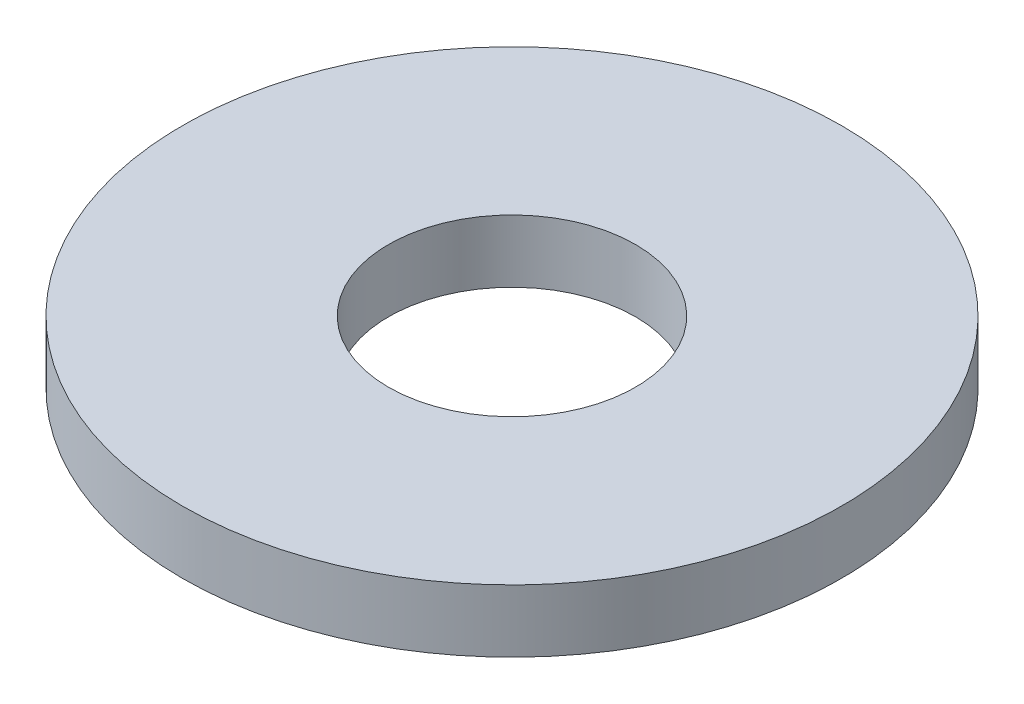
ISO-10303-21;
HEADER;
FILE_DESCRIPTION(('STEP AP214'),'2;1');
FILE_NAME('part.step','',(''),(''),'','','');
FILE_SCHEMA(('AUTOMOTIVE_DESIGN { 1 0 10303 214 1 1 1 1 }'));
ENDSEC;
DATA;
#1=APPLICATION_CONTEXT('core data for automotive mechanical design processes');
#2=APPLICATION_PROTOCOL_DEFINITION('international standard','automotive_design',2000,#1);
#3=PRODUCT_CONTEXT('',#1,'mechanical');
#4=PRODUCT('Part','Part','',(#3));
#5=PRODUCT_RELATED_PRODUCT_CATEGORY('part','',(#4));
#6=PRODUCT_DEFINITION_FORMATION('','',#4);
#7=PRODUCT_DEFINITION_CONTEXT('part definition',#1,'design');
#8=PRODUCT_DEFINITION('design','',#6,#7);
#9=PRODUCT_DEFINITION_SHAPE('','',#8);
#10=(LENGTH_UNIT() NAMED_UNIT(*) SI_UNIT(.MILLI.,.METRE.));
#11=(NAMED_UNIT(*) PLANE_ANGLE_UNIT() SI_UNIT($,.RADIAN.));
#12=(NAMED_UNIT(*) SI_UNIT($,.STERADIAN.) SOLID_ANGLE_UNIT());
#13=UNCERTAINTY_MEASURE_WITH_UNIT(LENGTH_MEASURE(1.E-05),#10,'distance_accuracy_value','');
#14=(GEOMETRIC_REPRESENTATION_CONTEXT(3) GLOBAL_UNCERTAINTY_ASSIGNED_CONTEXT((#13)) GLOBAL_UNIT_ASSIGNED_CONTEXT((#10,
#11,#12)) REPRESENTATION_CONTEXT('',''));
#15=CARTESIAN_POINT('',(0.,0.,0.));
#16=DIRECTION('',(0.,0.,1.));
#17=DIRECTION('',(1.,0.,0.));
#18=AXIS2_PLACEMENT_3D('',#15,#16,#17);
#19=CARTESIAN_POINT('',(0.,19.,0.));
#20=DIRECTION('',(0.,-1.,0.));
#21=DIRECTION('',(0.,0.,-1.));
#22=AXIS2_PLACEMENT_3D('',#19,#20,#21);
#23=CYLINDRICAL_SURFACE('',#22,100.);
#24=CARTESIAN_POINT('',(0.,19.,0.));
#25=DIRECTION('',(0.,1.,0.));
#26=DIRECTION('',(0.,0.,1.));
#27=AXIS2_PLACEMENT_3D('',#24,#25,#26);
#28=CIRCLE('',#27,100.);
#29=CARTESIAN_POINT('',(0.,19.,100.));
#30=VERTEX_POINT('',#29);
#31=EDGE_CURVE('E10',#30,#30,#28,.T.);
#32=ORIENTED_EDGE('',*,*,#31,.F.);
#33=EDGE_LOOP('',(#32));
#34=FACE_BOUND('',#33,.T.);
#35=CARTESIAN_POINT('',(0.,0.,0.));
#36=DIRECTION('',(0.,1.,0.));
#37=DIRECTION('',(0.,0.,1.));
#38=AXIS2_PLACEMENT_3D('',#35,#36,#37);
#39=CIRCLE('',#38,100.);
#40=CARTESIAN_POINT('',(0.,0.,100.));
#41=VERTEX_POINT('',#40);
#42=EDGE_CURVE('E37',#41,#41,#39,.T.);
#43=ORIENTED_EDGE('',*,*,#42,.T.);
#44=EDGE_LOOP('',(#43));
#45=FACE_BOUND('',#44,.T.);
#46=ADVANCED_FACE('F40',(#34,#45),#23,.T.);
#47=CARTESIAN_POINT('',(0.,19.,0.));
#48=DIRECTION('',(0.,1.,0.));
#49=DIRECTION('',(0.,0.,1.));
#50=AXIS2_PLACEMENT_3D('',#47,#48,#49);
#51=PLANE('',#50);
#52=CARTESIAN_POINT('',(0.,19.,0.));
#53=DIRECTION('',(0.,1.,0.));
#54=DIRECTION('',(0.,0.,1.));
#55=AXIS2_PLACEMENT_3D('',#52,#53,#54);
#56=CIRCLE('',#55,37.5);
#57=CARTESIAN_POINT('',(0.,19.,37.5));
#58=VERTEX_POINT('',#57);
#59=EDGE_CURVE('E50',#58,#58,#56,.T.);
#60=ORIENTED_EDGE('',*,*,#59,.F.);
#61=EDGE_LOOP('',(#60));
#62=FACE_BOUND('',#61,.T.);
#63=ORIENTED_EDGE('',*,*,#31,.T.);
#64=EDGE_LOOP('',(#63));
#65=FACE_BOUND('',#64,.T.);
#66=ADVANCED_FACE('F59',(#62,#65),#51,.T.);
#67=CARTESIAN_POINT('',(0.,0.,0.));
#68=DIRECTION('',(0.,1.,0.));
#69=DIRECTION('',(0.,0.,1.));
#70=AXIS2_PLACEMENT_3D('',#67,#68,#69);
#71=PLANE('',#70);
#72=CARTESIAN_POINT('',(0.,0.,0.));
#73=DIRECTION('',(0.,1.,0.));
#74=DIRECTION('',(0.,0.,1.));
#75=AXIS2_PLACEMENT_3D('',#72,#73,#74);
#76=CIRCLE('',#75,37.5);
#77=CARTESIAN_POINT('',(0.,0.,37.5));
#78=VERTEX_POINT('',#77);
#79=EDGE_CURVE('E47',#78,#78,#76,.T.);
#80=ORIENTED_EDGE('',*,*,#79,.T.);
#81=EDGE_LOOP('',(#80));
#82=FACE_BOUND('',#81,.T.);
#83=ORIENTED_EDGE('',*,*,#42,.F.);
#84=EDGE_LOOP('',(#83));
#85=FACE_BOUND('',#84,.T.);
#86=ADVANCED_FACE('F58',(#82,#85),#71,.F.);
#87=CARTESIAN_POINT('',(0.,19.,0.));
#88=DIRECTION('',(0.,-1.,0.));
#89=DIRECTION('',(0.,0.,-1.));
#90=AXIS2_PLACEMENT_3D('',#87,#88,#89);
#91=CYLINDRICAL_SURFACE('',#90,37.5);
#92=ORIENTED_EDGE('',*,*,#59,.T.);
#93=EDGE_LOOP('',(#92));
#94=FACE_BOUND('',#93,.T.);
#95=ORIENTED_EDGE('',*,*,#79,.F.);
#96=EDGE_LOOP('',(#95));
#97=FACE_BOUND('',#96,.T.);
#98=ADVANCED_FACE('F54',(#94,#97),#91,.F.);
#99=CLOSED_SHELL('',(#46,#66,#86,#98));
#100=MANIFOLD_SOLID_BREP('B2',#99);
#101=ADVANCED_BREP_SHAPE_REPRESENTATION('',(#18,#100),#14);
#102=SHAPE_DEFINITION_REPRESENTATION(#9,#101);
ENDSEC;
END-ISO-10303-21;
